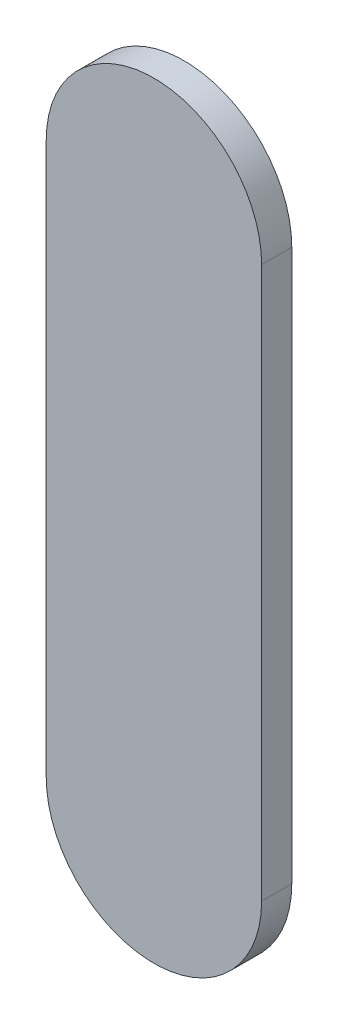
ISO-10303-21;
HEADER;
FILE_DESCRIPTION(('STEP AP214'),'2;1');
FILE_NAME('part.step','',(''),(''),'','','');
FILE_SCHEMA(('AUTOMOTIVE_DESIGN { 1 0 10303 214 1 1 1 1 }'));
ENDSEC;
DATA;
#1=APPLICATION_CONTEXT('core data for automotive mechanical design processes');
#2=APPLICATION_PROTOCOL_DEFINITION('international standard','automotive_design',2000,#1);
#3=PRODUCT_CONTEXT('',#1,'mechanical');
#4=PRODUCT('Part','Part','',(#3));
#5=PRODUCT_RELATED_PRODUCT_CATEGORY('part','',(#4));
#6=PRODUCT_DEFINITION_FORMATION('','',#4);
#7=PRODUCT_DEFINITION_CONTEXT('part definition',#1,'design');
#8=PRODUCT_DEFINITION('design','',#6,#7);
#9=PRODUCT_DEFINITION_SHAPE('','',#8);
#10=(LENGTH_UNIT() NAMED_UNIT(*) SI_UNIT(.MILLI.,.METRE.));
#11=(NAMED_UNIT(*) PLANE_ANGLE_UNIT() SI_UNIT($,.RADIAN.));
#12=(NAMED_UNIT(*) SI_UNIT($,.STERADIAN.) SOLID_ANGLE_UNIT());
#13=UNCERTAINTY_MEASURE_WITH_UNIT(LENGTH_MEASURE(1.E-05),#10,'distance_accuracy_value','');
#14=(GEOMETRIC_REPRESENTATION_CONTEXT(3) GLOBAL_UNCERTAINTY_ASSIGNED_CONTEXT((#13)) GLOBAL_UNIT_ASSIGNED_CONTEXT((#10,
#11,#12)) REPRESENTATION_CONTEXT('',''));
#15=CARTESIAN_POINT('',(0.,0.,0.));
#16=DIRECTION('',(0.,0.,1.));
#17=DIRECTION('',(1.,0.,0.));
#18=AXIS2_PLACEMENT_3D('',#15,#16,#17);
#19=CARTESIAN_POINT('',(96.4939904,85.6869508,0.));
#20=DIRECTION('',(-1.,0.,0.));
#21=DIRECTION('',(0.,1.,0.));
#22=AXIS2_PLACEMENT_3D('',#19,#20,#21);
#23=PLANE('',#22);
#24=DIRECTION('',(0.,1.,0.));
#25=VECTOR('',#24,1.);
#26=CARTESIAN_POINT('',(96.4939904,85.6869508,0.03556));
#27=LINE('',#26,#25);
#28=CARTESIAN_POINT('',(96.4939904,85.6869508,0.03556));
#29=VERTEX_POINT('',#28);
#30=CARTESIAN_POINT('',(96.4939904,86.33695458,0.03556));
#31=VERTEX_POINT('',#30);
#32=EDGE_CURVE('E11',#29,#31,#27,.T.);
#33=ORIENTED_EDGE('',*,*,#32,.F.);
#34=DIRECTION('',(0.,0.,1.));
#35=VECTOR('',#34,1.);
#36=CARTESIAN_POINT('',(96.4939904,85.6869508,0.));
#37=LINE('',#36,#35);
#38=CARTESIAN_POINT('',(96.4939904,85.6869508,0.));
#39=VERTEX_POINT('',#38);
#40=EDGE_CURVE('E24',#39,#29,#37,.T.);
#41=ORIENTED_EDGE('',*,*,#40,.F.);
#42=DIRECTION('',(0.,1.,0.));
#43=VECTOR('',#42,1.);
#44=CARTESIAN_POINT('',(96.4939904,85.6869508,0.));
#45=LINE('',#44,#43);
#46=CARTESIAN_POINT('',(96.4939904,86.33695458,0.));
#47=VERTEX_POINT('',#46);
#48=EDGE_CURVE('E75',#39,#47,#45,.T.);
#49=ORIENTED_EDGE('',*,*,#48,.T.);
#50=DIRECTION('',(0.,0.,1.));
#51=VECTOR('',#50,1.);
#52=CARTESIAN_POINT('',(96.4939904,86.33695458,0.));
#53=LINE('',#52,#51);
#54=EDGE_CURVE('E37',#47,#31,#53,.T.);
#55=ORIENTED_EDGE('',*,*,#54,.T.);
#56=EDGE_LOOP('',(#33,#41,#49,#55));
#57=FACE_BOUND('',#56,.T.);
#58=ADVANCED_FACE('F17',(#57),#23,.F.);
#59=CARTESIAN_POINT('',(96.3669904,86.33695458,0.));
#60=DIRECTION('',(0.,0.,-1.));
#61=DIRECTION('',(1.,0.,0.));
#62=AXIS2_PLACEMENT_3D('',#59,#60,#61);
#63=CYLINDRICAL_SURFACE('',#62,0.127);
#64=CARTESIAN_POINT('',(96.3669904,86.33695458,0.03556));
#65=DIRECTION('',(0.,0.,1.));
#66=DIRECTION('',(1.,0.,0.));
#67=AXIS2_PLACEMENT_3D('',#64,#65,#66);
#68=CIRCLE('',#67,0.127);
#69=CARTESIAN_POINT('',(96.2399904,86.33695458,0.03556));
#70=VERTEX_POINT('',#69);
#71=EDGE_CURVE('E83',#31,#70,#68,.T.);
#72=ORIENTED_EDGE('',*,*,#71,.F.);
#73=ORIENTED_EDGE('',*,*,#54,.F.);
#74=CARTESIAN_POINT('',(96.3669904,86.33695458,0.));
#75=DIRECTION('',(0.,0.,1.));
#76=DIRECTION('',(1.,0.,0.));
#77=AXIS2_PLACEMENT_3D('',#74,#75,#76);
#78=CIRCLE('',#77,0.127);
#79=CARTESIAN_POINT('',(96.2399904,86.33695458,0.));
#80=VERTEX_POINT('',#79);
#81=EDGE_CURVE('E81',#47,#80,#78,.T.);
#82=ORIENTED_EDGE('',*,*,#81,.T.);
#83=DIRECTION('',(0.,0.,1.));
#84=VECTOR('',#83,1.);
#85=CARTESIAN_POINT('',(96.2399904,86.33695458,0.));
#86=LINE('',#85,#84);
#87=EDGE_CURVE('E67',#80,#70,#86,.T.);
#88=ORIENTED_EDGE('',*,*,#87,.T.);
#89=EDGE_LOOP('',(#72,#73,#82,#88));
#90=FACE_BOUND('',#89,.T.);
#91=ADVANCED_FACE('F89',(#90),#63,.T.);
#92=CARTESIAN_POINT('',(96.2399904,86.33695458,0.));
#93=DIRECTION('',(1.,0.,0.));
#94=DIRECTION('',(0.,-1.,0.));
#95=AXIS2_PLACEMENT_3D('',#92,#93,#94);
#96=PLANE('',#95);
#97=DIRECTION('',(0.,-1.,0.));
#98=VECTOR('',#97,1.);
#99=CARTESIAN_POINT('',(96.2399904,86.33695458,0.03556));
#100=LINE('',#99,#98);
#101=CARTESIAN_POINT('',(96.2399904,85.6869508,0.03556));
#102=VERTEX_POINT('',#101);
#103=EDGE_CURVE('E71',#70,#102,#100,.T.);
#104=ORIENTED_EDGE('',*,*,#103,.F.);
#105=ORIENTED_EDGE('',*,*,#87,.F.);
#106=DIRECTION('',(0.,-1.,0.));
#107=VECTOR('',#106,1.);
#108=CARTESIAN_POINT('',(96.2399904,86.33695458,0.));
#109=LINE('',#108,#107);
#110=CARTESIAN_POINT('',(96.2399904,85.6869508,0.));
#111=VERTEX_POINT('',#110);
#112=EDGE_CURVE('E63',#80,#111,#109,.T.);
#113=ORIENTED_EDGE('',*,*,#112,.T.);
#114=DIRECTION('',(0.,0.,1.));
#115=VECTOR('',#114,1.);
#116=CARTESIAN_POINT('',(96.2399904,85.6869508,0.));
#117=LINE('',#116,#115);
#118=EDGE_CURVE('E53',#111,#102,#117,.T.);
#119=ORIENTED_EDGE('',*,*,#118,.T.);
#120=EDGE_LOOP('',(#104,#105,#113,#119));
#121=FACE_BOUND('',#120,.T.);
#122=ADVANCED_FACE('F66',(#121),#96,.F.);
#123=CARTESIAN_POINT('',(96.3669904,85.6869508,0.));
#124=DIRECTION('',(0.,0.,-1.));
#125=DIRECTION('',(-1.,-1.11896493820492E-13,0.));
#126=AXIS2_PLACEMENT_3D('',#123,#124,#125);
#127=CYLINDRICAL_SURFACE('',#126,0.127000000000005);
#128=CARTESIAN_POINT('',(96.3669904,85.6869508,0.03556));
#129=DIRECTION('',(0.,0.,1.));
#130=DIRECTION('',(-1.,-1.11896493820492E-13,0.));
#131=AXIS2_PLACEMENT_3D('',#128,#129,#130);
#132=CIRCLE('',#131,0.127000000000005);
#133=EDGE_CURVE('E59',#102,#29,#132,.T.);
#134=ORIENTED_EDGE('',*,*,#133,.F.);
#135=ORIENTED_EDGE('',*,*,#118,.F.);
#136=CARTESIAN_POINT('',(96.3669904,85.6869508,0.));
#137=DIRECTION('',(0.,0.,1.));
#138=DIRECTION('',(-1.,-1.11896493820492E-13,0.));
#139=AXIS2_PLACEMENT_3D('',#136,#137,#138);
#140=CIRCLE('',#139,0.127000000000005);
#141=EDGE_CURVE('E57',#111,#39,#140,.T.);
#142=ORIENTED_EDGE('',*,*,#141,.T.);
#143=ORIENTED_EDGE('',*,*,#40,.T.);
#144=EDGE_LOOP('',(#134,#135,#142,#143));
#145=FACE_BOUND('',#144,.T.);
#146=ADVANCED_FACE('F55',(#145),#127,.T.);
#147=CARTESIAN_POINT('',(96.4939904,85.6869508,0.));
#148=DIRECTION('',(0.,0.,-1.));
#149=DIRECTION('',(-1.,0.,0.));
#150=AXIS2_PLACEMENT_3D('',#147,#148,#149);
#151=PLANE('',#150);
#152=ORIENTED_EDGE('',*,*,#141,.F.);
#153=ORIENTED_EDGE('',*,*,#112,.F.);
#154=ORIENTED_EDGE('',*,*,#81,.F.);
#155=ORIENTED_EDGE('',*,*,#48,.F.);
#156=EDGE_LOOP('',(#152,#153,#154,#155));
#157=FACE_BOUND('',#156,.T.);
#158=ADVANCED_FACE('F74',(#157),#151,.T.);
#159=CARTESIAN_POINT('',(96.4939904,85.6869508,0.03556));
#160=DIRECTION('',(0.,0.,-1.));
#161=DIRECTION('',(-1.,0.,0.));
#162=AXIS2_PLACEMENT_3D('',#159,#160,#161);
#163=PLANE('',#162);
#164=ORIENTED_EDGE('',*,*,#32,.T.);
#165=ORIENTED_EDGE('',*,*,#71,.T.);
#166=ORIENTED_EDGE('',*,*,#103,.T.);
#167=ORIENTED_EDGE('',*,*,#133,.T.);
#168=EDGE_LOOP('',(#164,#165,#166,#167));
#169=FACE_BOUND('',#168,.T.);
#170=ADVANCED_FACE('F91',(#169),#163,.F.);
#171=CLOSED_SHELL('',(#58,#91,#122,#146,#158,#170));
#172=MANIFOLD_SOLID_BREP('B1',#171);
#173=ADVANCED_BREP_SHAPE_REPRESENTATION('',(#18,#172),#14);
#174=SHAPE_DEFINITION_REPRESENTATION(#9,#173);
ENDSEC;
END-ISO-10303-21;
